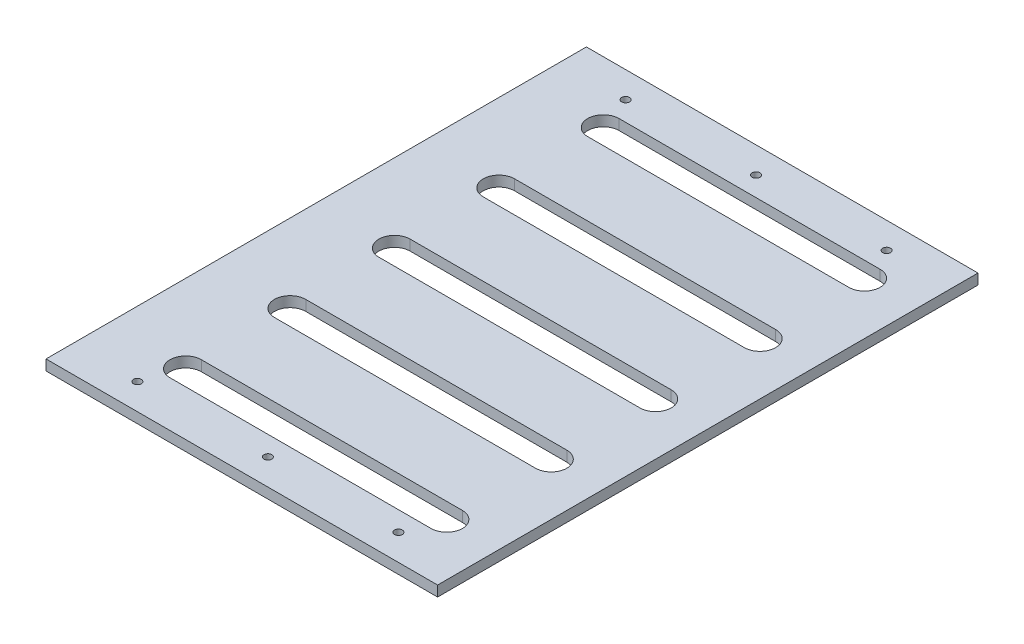
ISO-10303-21;
HEADER;
FILE_DESCRIPTION(('STEP AP214'),'2;1');
FILE_NAME('part.step','',(''),(''),'','','');
FILE_SCHEMA(('AUTOMOTIVE_DESIGN { 1 0 10303 214 1 1 1 1 }'));
ENDSEC;
DATA;
#1=APPLICATION_CONTEXT('core data for automotive mechanical design processes');
#2=APPLICATION_PROTOCOL_DEFINITION('international standard','automotive_design',2000,#1);
#3=PRODUCT_CONTEXT('',#1,'mechanical');
#4=PRODUCT('Part','Part','',(#3));
#5=PRODUCT_RELATED_PRODUCT_CATEGORY('part','',(#4));
#6=PRODUCT_DEFINITION_FORMATION('','',#4);
#7=PRODUCT_DEFINITION_CONTEXT('part definition',#1,'design');
#8=PRODUCT_DEFINITION('design','',#6,#7);
#9=PRODUCT_DEFINITION_SHAPE('','',#8);
#10=(LENGTH_UNIT() NAMED_UNIT(*) SI_UNIT(.MILLI.,.METRE.));
#11=(NAMED_UNIT(*) PLANE_ANGLE_UNIT() SI_UNIT($,.RADIAN.));
#12=(NAMED_UNIT(*) SI_UNIT($,.STERADIAN.) SOLID_ANGLE_UNIT());
#13=UNCERTAINTY_MEASURE_WITH_UNIT(LENGTH_MEASURE(1.E-05),#10,'distance_accuracy_value','');
#14=(GEOMETRIC_REPRESENTATION_CONTEXT(3) GLOBAL_UNCERTAINTY_ASSIGNED_CONTEXT((#13)) GLOBAL_UNIT_ASSIGNED_CONTEXT((#10,
#11,#12)) REPRESENTATION_CONTEXT('',''));
#15=CARTESIAN_POINT('',(0.,0.,0.));
#16=DIRECTION('',(0.,0.,1.));
#17=DIRECTION('',(1.,0.,0.));
#18=AXIS2_PLACEMENT_3D('',#15,#16,#17);
#19=CARTESIAN_POINT('',(0.,4.,0.));
#20=DIRECTION('',(1.,0.,0.));
#21=DIRECTION('',(0.,0.,-1.));
#22=AXIS2_PLACEMENT_3D('',#19,#20,#21);
#23=PLANE('',#22);
#24=DIRECTION('',(0.,0.,1.));
#25=VECTOR('',#24,1.);
#26=CARTESIAN_POINT('',(0.,0.,0.));
#27=LINE('',#26,#25);
#28=CARTESIAN_POINT('',(0.,0.,-207.));
#29=VERTEX_POINT('',#28);
#30=CARTESIAN_POINT('',(0.,0.,0.));
#31=VERTEX_POINT('',#30);
#32=EDGE_CURVE('E355',#29,#31,#27,.T.);
#33=ORIENTED_EDGE('',*,*,#32,.T.);
#34=DIRECTION('',(0.,-1.,0.));
#35=VECTOR('',#34,1.);
#36=CARTESIAN_POINT('',(0.,4.,0.));
#37=LINE('',#36,#35);
#38=CARTESIAN_POINT('',(0.,4.,0.));
#39=VERTEX_POINT('',#38);
#40=EDGE_CURVE('E11',#39,#31,#37,.T.);
#41=ORIENTED_EDGE('',*,*,#40,.F.);
#42=DIRECTION('',(0.,0.,1.));
#43=VECTOR('',#42,1.);
#44=CARTESIAN_POINT('',(0.,4.,0.));
#45=LINE('',#44,#43);
#46=CARTESIAN_POINT('',(0.,4.,-207.));
#47=VERTEX_POINT('',#46);
#48=EDGE_CURVE('E362',#47,#39,#45,.T.);
#49=ORIENTED_EDGE('',*,*,#48,.F.);
#50=DIRECTION('',(0.,-1.,0.));
#51=VECTOR('',#50,1.);
#52=CARTESIAN_POINT('',(0.,4.,-207.));
#53=LINE('',#52,#51);
#54=EDGE_CURVE('E372',#47,#29,#53,.T.);
#55=ORIENTED_EDGE('',*,*,#54,.T.);
#56=EDGE_LOOP('',(#33,#41,#49,#55));
#57=FACE_BOUND('',#56,.T.);
#58=ADVANCED_FACE('F32',(#57),#23,.F.);
#59=CARTESIAN_POINT('',(0.,4.,0.));
#60=DIRECTION('',(0.,0.,-1.));
#61=DIRECTION('',(-1.,0.,0.));
#62=AXIS2_PLACEMENT_3D('',#59,#60,#61);
#63=PLANE('',#62);
#64=DIRECTION('',(1.,0.,0.));
#65=VECTOR('',#64,1.);
#66=CARTESIAN_POINT('',(0.,0.,0.));
#67=LINE('',#66,#65);
#68=CARTESIAN_POINT('',(150.,0.,0.));
#69=VERTEX_POINT('',#68);
#70=EDGE_CURVE('E375',#31,#69,#67,.T.);
#71=ORIENTED_EDGE('',*,*,#70,.T.);
#72=DIRECTION('',(0.,-1.,0.));
#73=VECTOR('',#72,1.);
#74=CARTESIAN_POINT('',(150.,4.,0.));
#75=LINE('',#74,#73);
#76=CARTESIAN_POINT('',(150.,4.,0.));
#77=VERTEX_POINT('',#76);
#78=EDGE_CURVE('E39',#77,#69,#75,.T.);
#79=ORIENTED_EDGE('',*,*,#78,.F.);
#80=DIRECTION('',(1.,0.,0.));
#81=VECTOR('',#80,1.);
#82=CARTESIAN_POINT('',(0.,4.,0.));
#83=LINE('',#82,#81);
#84=EDGE_CURVE('E365',#39,#77,#83,.T.);
#85=ORIENTED_EDGE('',*,*,#84,.F.);
#86=ORIENTED_EDGE('',*,*,#40,.T.);
#87=EDGE_LOOP('',(#71,#79,#85,#86));
#88=FACE_BOUND('',#87,.T.);
#89=ADVANCED_FACE('F404',(#88),#63,.F.);
#90=CARTESIAN_POINT('',(150.,4.,0.));
#91=DIRECTION('',(-1.,0.,0.));
#92=DIRECTION('',(0.,0.,1.));
#93=AXIS2_PLACEMENT_3D('',#90,#91,#92);
#94=PLANE('',#93);
#95=DIRECTION('',(0.,0.,-1.));
#96=VECTOR('',#95,1.);
#97=CARTESIAN_POINT('',(150.,0.,0.));
#98=LINE('',#97,#96);
#99=CARTESIAN_POINT('',(150.,0.,-207.));
#100=VERTEX_POINT('',#99);
#101=EDGE_CURVE('E377',#69,#100,#98,.T.);
#102=ORIENTED_EDGE('',*,*,#101,.T.);
#103=DIRECTION('',(0.,-1.,0.));
#104=VECTOR('',#103,1.);
#105=CARTESIAN_POINT('',(150.,4.,-207.));
#106=LINE('',#105,#104);
#107=CARTESIAN_POINT('',(150.,4.,-207.));
#108=VERTEX_POINT('',#107);
#109=EDGE_CURVE('E382',#108,#100,#106,.T.);
#110=ORIENTED_EDGE('',*,*,#109,.F.);
#111=DIRECTION('',(0.,0.,-1.));
#112=VECTOR('',#111,1.);
#113=CARTESIAN_POINT('',(150.,4.,0.));
#114=LINE('',#113,#112);
#115=EDGE_CURVE('E368',#77,#108,#114,.T.);
#116=ORIENTED_EDGE('',*,*,#115,.F.);
#117=ORIENTED_EDGE('',*,*,#78,.T.);
#118=EDGE_LOOP('',(#102,#110,#116,#117));
#119=FACE_BOUND('',#118,.T.);
#120=ADVANCED_FACE('F389',(#119),#94,.F.);
#121=CARTESIAN_POINT('',(0.,4.,-207.));
#122=DIRECTION('',(0.,0.,1.));
#123=DIRECTION('',(1.,0.,0.));
#124=AXIS2_PLACEMENT_3D('',#121,#122,#123);
#125=PLANE('',#124);
#126=DIRECTION('',(-1.,0.,0.));
#127=VECTOR('',#126,1.);
#128=CARTESIAN_POINT('',(0.,0.,-207.));
#129=LINE('',#128,#127);
#130=EDGE_CURVE('E366',#100,#29,#129,.T.);
#131=ORIENTED_EDGE('',*,*,#130,.T.);
#132=ORIENTED_EDGE('',*,*,#54,.F.);
#133=DIRECTION('',(-1.,0.,0.));
#134=VECTOR('',#133,1.);
#135=CARTESIAN_POINT('',(0.,4.,-207.));
#136=LINE('',#135,#134);
#137=EDGE_CURVE('E370',#108,#47,#136,.T.);
#138=ORIENTED_EDGE('',*,*,#137,.F.);
#139=ORIENTED_EDGE('',*,*,#109,.T.);
#140=EDGE_LOOP('',(#131,#132,#138,#139));
#141=FACE_BOUND('',#140,.T.);
#142=ADVANCED_FACE('F397',(#141),#125,.F.);
#143=CARTESIAN_POINT('',(0.,4.,0.));
#144=DIRECTION('',(0.,-1.,0.));
#145=DIRECTION('',(0.,0.,-1.));
#146=AXIS2_PLACEMENT_3D('',#143,#144,#145);
#147=PLANE('',#146);
#148=CARTESIAN_POINT('',(75.,4.,-197.));
#149=DIRECTION('',(0.,1.,0.));
#150=DIRECTION('',(0.,0.,1.));
#151=AXIS2_PLACEMENT_3D('',#148,#149,#150);
#152=CIRCLE('',#151,1.50000000000001);
#153=CARTESIAN_POINT('',(75.,4.,-195.5));
#154=VERTEX_POINT('',#153);
#155=EDGE_CURVE('E526',#154,#154,#152,.T.);
#156=ORIENTED_EDGE('',*,*,#155,.F.);
#157=EDGE_LOOP('',(#156));
#158=FACE_BOUND('',#157,.T.);
#159=CARTESIAN_POINT('',(25.,4.,-197.));
#160=DIRECTION('',(0.,1.,0.));
#161=DIRECTION('',(0.,0.,1.));
#162=AXIS2_PLACEMENT_3D('',#159,#160,#161);
#163=CIRCLE('',#162,1.5);
#164=CARTESIAN_POINT('',(25.,4.,-195.5));
#165=VERTEX_POINT('',#164);
#166=EDGE_CURVE('E531',#165,#165,#163,.T.);
#167=ORIENTED_EDGE('',*,*,#166,.F.);
#168=EDGE_LOOP('',(#167));
#169=FACE_BOUND('',#168,.T.);
#170=CARTESIAN_POINT('',(25.,4.,-10.));
#171=DIRECTION('',(0.,1.,0.));
#172=DIRECTION('',(0.,0.,-1.));
#173=AXIS2_PLACEMENT_3D('',#170,#171,#172);
#174=CIRCLE('',#173,1.5);
#175=CARTESIAN_POINT('',(25.,4.,-11.5));
#176=VERTEX_POINT('',#175);
#177=EDGE_CURVE('E539',#176,#176,#174,.T.);
#178=ORIENTED_EDGE('',*,*,#177,.F.);
#179=EDGE_LOOP('',(#178));
#180=FACE_BOUND('',#179,.T.);
#181=CARTESIAN_POINT('',(75.,4.,-9.99999999999995));
#182=DIRECTION('',(0.,1.,0.));
#183=DIRECTION('',(0.,0.,-1.));
#184=AXIS2_PLACEMENT_3D('',#181,#182,#183);
#185=CIRCLE('',#184,1.50000000000001);
#186=CARTESIAN_POINT('',(75.,4.,-11.5));
#187=VERTEX_POINT('',#186);
#188=EDGE_CURVE('E545',#187,#187,#185,.T.);
#189=ORIENTED_EDGE('',*,*,#188,.F.);
#190=EDGE_LOOP('',(#189));
#191=FACE_BOUND('',#190,.T.);
#192=CARTESIAN_POINT('',(125.,4.,-10.));
#193=DIRECTION('',(0.,1.,0.));
#194=DIRECTION('',(0.,0.,-1.));
#195=AXIS2_PLACEMENT_3D('',#192,#193,#194);
#196=CIRCLE('',#195,1.5);
#197=CARTESIAN_POINT('',(125.,4.,-11.5));
#198=VERTEX_POINT('',#197);
#199=EDGE_CURVE('E551',#198,#198,#196,.T.);
#200=ORIENTED_EDGE('',*,*,#199,.F.);
#201=EDGE_LOOP('',(#200));
#202=FACE_BOUND('',#201,.T.);
#203=CARTESIAN_POINT('',(125.,4.,-197.));
#204=DIRECTION('',(0.,1.,0.));
#205=DIRECTION('',(0.,0.,1.));
#206=AXIS2_PLACEMENT_3D('',#203,#204,#205);
#207=CIRCLE('',#206,1.5);
#208=CARTESIAN_POINT('',(125.,4.,-195.5));
#209=VERTEX_POINT('',#208);
#210=EDGE_CURVE('E219',#209,#209,#207,.T.);
#211=ORIENTED_EDGE('',*,*,#210,.F.);
#212=EDGE_LOOP('',(#211));
#213=FACE_BOUND('',#212,.T.);
#214=DIRECTION('',(1.,0.,0.));
#215=VECTOR('',#214,1.);
#216=CARTESIAN_POINT('',(30.,4.,-137.5));
#217=LINE('',#216,#215);
#218=CARTESIAN_POINT('',(30.,4.,-137.5));
#219=VERTEX_POINT('',#218);
#220=CARTESIAN_POINT('',(130.,4.,-137.5));
#221=VERTEX_POINT('',#220);
#222=EDGE_CURVE('E225',#219,#221,#217,.T.);
#223=ORIENTED_EDGE('',*,*,#222,.F.);
#224=CARTESIAN_POINT('',(30.,4.,-143.5));
#225=DIRECTION('',(0.,1.,0.));
#226=DIRECTION('',(0.,0.,1.));
#227=AXIS2_PLACEMENT_3D('',#224,#225,#226);
#228=CIRCLE('',#227,6.00000000000001);
#229=CARTESIAN_POINT('',(30.,4.,-149.5));
#230=VERTEX_POINT('',#229);
#231=EDGE_CURVE('E46',#230,#219,#228,.T.);
#232=ORIENTED_EDGE('',*,*,#231,.F.);
#233=DIRECTION('',(-1.,0.,0.));
#234=VECTOR('',#233,1.);
#235=CARTESIAN_POINT('',(30.,4.,-149.5));
#236=LINE('',#235,#234);
#237=CARTESIAN_POINT('',(130.,4.,-149.5));
#238=VERTEX_POINT('',#237);
#239=EDGE_CURVE('E213',#238,#230,#236,.T.);
#240=ORIENTED_EDGE('',*,*,#239,.F.);
#241=CARTESIAN_POINT('',(130.,4.,-143.5));
#242=DIRECTION('',(0.,1.,0.));
#243=DIRECTION('',(0.,0.,1.));
#244=AXIS2_PLACEMENT_3D('',#241,#242,#243);
#245=CIRCLE('',#244,6.00000000000001);
#246=EDGE_CURVE('E216',#221,#238,#245,.T.);
#247=ORIENTED_EDGE('',*,*,#246,.F.);
#248=EDGE_LOOP('',(#223,#232,#240,#247));
#249=FACE_BOUND('',#248,.T.);
#250=DIRECTION('',(1.,0.,0.));
#251=VECTOR('',#250,1.);
#252=CARTESIAN_POINT('',(30.,4.,-97.5));
#253=LINE('',#252,#251);
#254=CARTESIAN_POINT('',(30.,4.,-97.5));
#255=VERTEX_POINT('',#254);
#256=CARTESIAN_POINT('',(130.,4.,-97.5));
#257=VERTEX_POINT('',#256);
#258=EDGE_CURVE('E251',#255,#257,#253,.T.);
#259=ORIENTED_EDGE('',*,*,#258,.F.);
#260=CARTESIAN_POINT('',(30.,4.,-103.5));
#261=DIRECTION('',(0.,1.,0.));
#262=DIRECTION('',(0.,0.,-1.));
#263=AXIS2_PLACEMENT_3D('',#260,#261,#262);
#264=CIRCLE('',#263,6.00000000000001);
#265=CARTESIAN_POINT('',(30.,4.,-109.5));
#266=VERTEX_POINT('',#265);
#267=EDGE_CURVE('E54',#266,#255,#264,.T.);
#268=ORIENTED_EDGE('',*,*,#267,.F.);
#269=DIRECTION('',(-1.,0.,0.));
#270=VECTOR('',#269,1.);
#271=CARTESIAN_POINT('',(30.,4.,-109.5));
#272=LINE('',#271,#270);
#273=CARTESIAN_POINT('',(130.,4.,-109.5));
#274=VERTEX_POINT('',#273);
#275=EDGE_CURVE('E240',#274,#266,#272,.T.);
#276=ORIENTED_EDGE('',*,*,#275,.F.);
#277=CARTESIAN_POINT('',(130.,4.,-103.5));
#278=DIRECTION('',(0.,1.,0.));
#279=DIRECTION('',(0.,0.,-1.));
#280=AXIS2_PLACEMENT_3D('',#277,#278,#279);
#281=CIRCLE('',#280,6.00000000000001);
#282=EDGE_CURVE('E255',#257,#274,#281,.T.);
#283=ORIENTED_EDGE('',*,*,#282,.F.);
#284=EDGE_LOOP('',(#259,#268,#276,#283));
#285=FACE_BOUND('',#284,.T.);
#286=DIRECTION('',(1.,0.,0.));
#287=VECTOR('',#286,1.);
#288=CARTESIAN_POINT('',(30.,4.,-57.5));
#289=LINE('',#288,#287);
#290=CARTESIAN_POINT('',(30.,4.,-57.5));
#291=VERTEX_POINT('',#290);
#292=CARTESIAN_POINT('',(130.,4.,-57.5));
#293=VERTEX_POINT('',#292);
#294=EDGE_CURVE('E282',#291,#293,#289,.T.);
#295=ORIENTED_EDGE('',*,*,#294,.F.);
#296=CARTESIAN_POINT('',(30.,4.,-63.5));
#297=DIRECTION('',(0.,1.,0.));
#298=DIRECTION('',(0.,0.,-1.));
#299=AXIS2_PLACEMENT_3D('',#296,#297,#298);
#300=CIRCLE('',#299,6.00000000000001);
#301=CARTESIAN_POINT('',(30.,4.,-69.5));
#302=VERTEX_POINT('',#301);
#303=EDGE_CURVE('E280',#302,#291,#300,.T.);
#304=ORIENTED_EDGE('',*,*,#303,.F.);
#305=DIRECTION('',(-1.,0.,0.));
#306=VECTOR('',#305,1.);
#307=CARTESIAN_POINT('',(30.,4.,-69.5));
#308=LINE('',#307,#306);
#309=CARTESIAN_POINT('',(130.,4.,-69.5000000000001));
#310=VERTEX_POINT('',#309);
#311=EDGE_CURVE('E270',#310,#302,#308,.T.);
#312=ORIENTED_EDGE('',*,*,#311,.F.);
#313=CARTESIAN_POINT('',(130.,4.,-63.5000000000001));
#314=DIRECTION('',(0.,1.,0.));
#315=DIRECTION('',(0.,0.,-1.));
#316=AXIS2_PLACEMENT_3D('',#313,#314,#315);
#317=CIRCLE('',#316,6.00000000000001);
#318=EDGE_CURVE('E286',#293,#310,#317,.T.);
#319=ORIENTED_EDGE('',*,*,#318,.F.);
#320=EDGE_LOOP('',(#295,#304,#312,#319));
#321=FACE_BOUND('',#320,.T.);
#322=DIRECTION('',(1.,0.,0.));
#323=VECTOR('',#322,1.);
#324=CARTESIAN_POINT('',(30.,4.,-17.5));
#325=LINE('',#324,#323);
#326=CARTESIAN_POINT('',(30.,4.,-17.5));
#327=VERTEX_POINT('',#326);
#328=CARTESIAN_POINT('',(130.,4.,-17.5));
#329=VERTEX_POINT('',#328);
#330=EDGE_CURVE('E314',#327,#329,#325,.T.);
#331=ORIENTED_EDGE('',*,*,#330,.F.);
#332=CARTESIAN_POINT('',(30.,4.,-23.5));
#333=DIRECTION('',(0.,1.,0.));
#334=DIRECTION('',(0.,0.,-1.));
#335=AXIS2_PLACEMENT_3D('',#332,#333,#334);
#336=CIRCLE('',#335,5.99999999999998);
#337=CARTESIAN_POINT('',(30.,4.,-29.5));
#338=VERTEX_POINT('',#337);
#339=EDGE_CURVE('E312',#338,#327,#336,.T.);
#340=ORIENTED_EDGE('',*,*,#339,.F.);
#341=DIRECTION('',(-1.,0.,0.));
#342=VECTOR('',#341,1.);
#343=CARTESIAN_POINT('',(30.,4.,-29.5));
#344=LINE('',#343,#342);
#345=CARTESIAN_POINT('',(130.,4.,-29.5));
#346=VERTEX_POINT('',#345);
#347=EDGE_CURVE('E302',#346,#338,#344,.T.);
#348=ORIENTED_EDGE('',*,*,#347,.F.);
#349=CARTESIAN_POINT('',(130.,4.,-23.5));
#350=DIRECTION('',(0.,1.,0.));
#351=DIRECTION('',(0.,0.,-1.));
#352=AXIS2_PLACEMENT_3D('',#349,#350,#351);
#353=CIRCLE('',#352,6.);
#354=EDGE_CURVE('E318',#329,#346,#353,.T.);
#355=ORIENTED_EDGE('',*,*,#354,.F.);
#356=EDGE_LOOP('',(#331,#340,#348,#355));
#357=FACE_BOUND('',#356,.T.);
#358=DIRECTION('',(1.,0.,0.));
#359=VECTOR('',#358,1.);
#360=CARTESIAN_POINT('',(30.,4.,-177.5));
#361=LINE('',#360,#359);
#362=CARTESIAN_POINT('',(30.,4.,-177.5));
#363=VERTEX_POINT('',#362);
#364=CARTESIAN_POINT('',(130.,4.,-177.5));
#365=VERTEX_POINT('',#364);
#366=EDGE_CURVE('E345',#363,#365,#361,.T.);
#367=ORIENTED_EDGE('',*,*,#366,.F.);
#368=CARTESIAN_POINT('',(30.,4.,-183.5));
#369=DIRECTION('',(0.,1.,0.));
#370=DIRECTION('',(0.,0.,1.));
#371=AXIS2_PLACEMENT_3D('',#368,#369,#370);
#372=CIRCLE('',#371,5.99999999999998);
#373=CARTESIAN_POINT('',(30.,4.,-189.5));
#374=VERTEX_POINT('',#373);
#375=EDGE_CURVE('E232',#374,#363,#372,.T.);
#376=ORIENTED_EDGE('',*,*,#375,.F.);
#377=DIRECTION('',(-1.,0.,0.));
#378=VECTOR('',#377,1.);
#379=CARTESIAN_POINT('',(30.,4.,-189.5));
#380=LINE('',#379,#378);
#381=CARTESIAN_POINT('',(130.,4.,-189.5));
#382=VERTEX_POINT('',#381);
#383=EDGE_CURVE('E334',#382,#374,#380,.T.);
#384=ORIENTED_EDGE('',*,*,#383,.F.);
#385=CARTESIAN_POINT('',(130.,4.,-183.5));
#386=DIRECTION('',(0.,1.,0.));
#387=DIRECTION('',(0.,0.,1.));
#388=AXIS2_PLACEMENT_3D('',#385,#386,#387);
#389=CIRCLE('',#388,5.99999999999999);
#390=EDGE_CURVE('E348',#365,#382,#389,.T.);
#391=ORIENTED_EDGE('',*,*,#390,.F.);
#392=EDGE_LOOP('',(#367,#376,#384,#391));
#393=FACE_BOUND('',#392,.T.);
#394=ORIENTED_EDGE('',*,*,#48,.T.);
#395=ORIENTED_EDGE('',*,*,#84,.T.);
#396=ORIENTED_EDGE('',*,*,#115,.T.);
#397=ORIENTED_EDGE('',*,*,#137,.T.);
#398=EDGE_LOOP('',(#394,#395,#396,#397));
#399=FACE_BOUND('',#398,.T.);
#400=ADVANCED_FACE('F403',(#158,#169,#180,#191,#202,#213,#249,#285,#321,#357,#393,#399),#147,.F.);
#401=CARTESIAN_POINT('',(0.,0.,0.));
#402=DIRECTION('',(0.,-1.,0.));
#403=DIRECTION('',(0.,0.,-1.));
#404=AXIS2_PLACEMENT_3D('',#401,#402,#403);
#405=PLANE('',#404);
#406=CARTESIAN_POINT('',(75.,0.,-197.));
#407=DIRECTION('',(0.,1.,0.));
#408=DIRECTION('',(0.,0.,1.));
#409=AXIS2_PLACEMENT_3D('',#406,#407,#408);
#410=CIRCLE('',#409,1.50000000000001);
#411=CARTESIAN_POINT('',(75.,0.,-195.5));
#412=VERTEX_POINT('',#411);
#413=EDGE_CURVE('E523',#412,#412,#410,.T.);
#414=ORIENTED_EDGE('',*,*,#413,.T.);
#415=EDGE_LOOP('',(#414));
#416=FACE_BOUND('',#415,.T.);
#417=CARTESIAN_POINT('',(25.,0.,-197.));
#418=DIRECTION('',(0.,1.,0.));
#419=DIRECTION('',(0.,0.,1.));
#420=AXIS2_PLACEMENT_3D('',#417,#418,#419);
#421=CIRCLE('',#420,1.5);
#422=CARTESIAN_POINT('',(25.,0.,-195.5));
#423=VERTEX_POINT('',#422);
#424=EDGE_CURVE('E527',#423,#423,#421,.T.);
#425=ORIENTED_EDGE('',*,*,#424,.T.);
#426=EDGE_LOOP('',(#425));
#427=FACE_BOUND('',#426,.T.);
#428=CARTESIAN_POINT('',(25.,0.,-10.));
#429=DIRECTION('',(0.,1.,0.));
#430=DIRECTION('',(0.,0.,-1.));
#431=AXIS2_PLACEMENT_3D('',#428,#429,#430);
#432=CIRCLE('',#431,1.5);
#433=CARTESIAN_POINT('',(25.,0.,-11.5));
#434=VERTEX_POINT('',#433);
#435=EDGE_CURVE('E536',#434,#434,#432,.T.);
#436=ORIENTED_EDGE('',*,*,#435,.T.);
#437=EDGE_LOOP('',(#436));
#438=FACE_BOUND('',#437,.T.);
#439=CARTESIAN_POINT('',(75.,0.,-9.99999999999995));
#440=DIRECTION('',(0.,1.,0.));
#441=DIRECTION('',(0.,0.,-1.));
#442=AXIS2_PLACEMENT_3D('',#439,#440,#441);
#443=CIRCLE('',#442,1.50000000000001);
#444=CARTESIAN_POINT('',(75.,0.,-11.5));
#445=VERTEX_POINT('',#444);
#446=EDGE_CURVE('E542',#445,#445,#443,.T.);
#447=ORIENTED_EDGE('',*,*,#446,.T.);
#448=EDGE_LOOP('',(#447));
#449=FACE_BOUND('',#448,.T.);
#450=CARTESIAN_POINT('',(125.,0.,-10.));
#451=DIRECTION('',(0.,1.,0.));
#452=DIRECTION('',(0.,0.,-1.));
#453=AXIS2_PLACEMENT_3D('',#450,#451,#452);
#454=CIRCLE('',#453,1.5);
#455=CARTESIAN_POINT('',(125.,0.,-11.5));
#456=VERTEX_POINT('',#455);
#457=EDGE_CURVE('E548',#456,#456,#454,.T.);
#458=ORIENTED_EDGE('',*,*,#457,.T.);
#459=EDGE_LOOP('',(#458));
#460=FACE_BOUND('',#459,.T.);
#461=CARTESIAN_POINT('',(125.,0.,-197.));
#462=DIRECTION('',(0.,1.,0.));
#463=DIRECTION('',(0.,0.,1.));
#464=AXIS2_PLACEMENT_3D('',#461,#462,#463);
#465=CIRCLE('',#464,1.5);
#466=CARTESIAN_POINT('',(125.,0.,-195.5));
#467=VERTEX_POINT('',#466);
#468=EDGE_CURVE('E315',#467,#467,#465,.T.);
#469=ORIENTED_EDGE('',*,*,#468,.T.);
#470=EDGE_LOOP('',(#469));
#471=FACE_BOUND('',#470,.T.);
#472=CARTESIAN_POINT('',(30.,0.,-143.5));
#473=DIRECTION('',(0.,1.,0.));
#474=DIRECTION('',(0.,0.,1.));
#475=AXIS2_PLACEMENT_3D('',#472,#473,#474);
#476=CIRCLE('',#475,6.00000000000001);
#477=CARTESIAN_POINT('',(30.,0.,-149.5));
#478=VERTEX_POINT('',#477);
#479=CARTESIAN_POINT('',(30.,0.,-137.5));
#480=VERTEX_POINT('',#479);
#481=EDGE_CURVE('E194',#478,#480,#476,.T.);
#482=ORIENTED_EDGE('',*,*,#481,.T.);
#483=DIRECTION('',(1.,0.,0.));
#484=VECTOR('',#483,1.);
#485=CARTESIAN_POINT('',(30.,0.,-137.5));
#486=LINE('',#485,#484);
#487=CARTESIAN_POINT('',(130.,0.,-137.5));
#488=VERTEX_POINT('',#487);
#489=EDGE_CURVE('E204',#480,#488,#486,.T.);
#490=ORIENTED_EDGE('',*,*,#489,.T.);
#491=CARTESIAN_POINT('',(130.,0.,-143.5));
#492=DIRECTION('',(0.,1.,0.));
#493=DIRECTION('',(0.,0.,1.));
#494=AXIS2_PLACEMENT_3D('',#491,#492,#493);
#495=CIRCLE('',#494,6.00000000000001);
#496=CARTESIAN_POINT('',(130.,0.,-149.5));
#497=VERTEX_POINT('',#496);
#498=EDGE_CURVE('E208',#488,#497,#495,.T.);
#499=ORIENTED_EDGE('',*,*,#498,.T.);
#500=DIRECTION('',(-1.,0.,0.));
#501=VECTOR('',#500,1.);
#502=CARTESIAN_POINT('',(30.,0.,-149.5));
#503=LINE('',#502,#501);
#504=EDGE_CURVE('E200',#497,#478,#503,.T.);
#505=ORIENTED_EDGE('',*,*,#504,.T.);
#506=EDGE_LOOP('',(#482,#490,#499,#505));
#507=FACE_BOUND('',#506,.T.);
#508=CARTESIAN_POINT('',(30.,0.,-103.5));
#509=DIRECTION('',(0.,1.,0.));
#510=DIRECTION('',(0.,0.,-1.));
#511=AXIS2_PLACEMENT_3D('',#508,#509,#510);
#512=CIRCLE('',#511,6.00000000000001);
#513=CARTESIAN_POINT('',(30.,0.,-109.5));
#514=VERTEX_POINT('',#513);
#515=CARTESIAN_POINT('',(30.,0.,-97.5));
#516=VERTEX_POINT('',#515);
#517=EDGE_CURVE('E236',#514,#516,#512,.T.);
#518=ORIENTED_EDGE('',*,*,#517,.T.);
#519=DIRECTION('',(1.,0.,0.));
#520=VECTOR('',#519,1.);
#521=CARTESIAN_POINT('',(30.,0.,-97.5));
#522=LINE('',#521,#520);
#523=CARTESIAN_POINT('',(130.,0.,-97.5));
#524=VERTEX_POINT('',#523);
#525=EDGE_CURVE('E239',#516,#524,#522,.T.);
#526=ORIENTED_EDGE('',*,*,#525,.T.);
#527=CARTESIAN_POINT('',(130.,0.,-103.5));
#528=DIRECTION('',(0.,1.,0.));
#529=DIRECTION('',(0.,0.,-1.));
#530=AXIS2_PLACEMENT_3D('',#527,#528,#529);
#531=CIRCLE('',#530,6.00000000000001);
#532=CARTESIAN_POINT('',(130.,0.,-109.5));
#533=VERTEX_POINT('',#532);
#534=EDGE_CURVE('E243',#524,#533,#531,.T.);
#535=ORIENTED_EDGE('',*,*,#534,.T.);
#536=DIRECTION('',(-1.,0.,0.));
#537=VECTOR('',#536,1.);
#538=CARTESIAN_POINT('',(30.,0.,-109.5));
#539=LINE('',#538,#537);
#540=EDGE_CURVE('E246',#533,#514,#539,.T.);
#541=ORIENTED_EDGE('',*,*,#540,.T.);
#542=EDGE_LOOP('',(#518,#526,#535,#541));
#543=FACE_BOUND('',#542,.T.);
#544=CARTESIAN_POINT('',(30.,0.,-63.5));
#545=DIRECTION('',(0.,1.,0.));
#546=DIRECTION('',(0.,0.,-1.));
#547=AXIS2_PLACEMENT_3D('',#544,#545,#546);
#548=CIRCLE('',#547,6.00000000000001);
#549=CARTESIAN_POINT('',(30.,0.,-69.5));
#550=VERTEX_POINT('',#549);
#551=CARTESIAN_POINT('',(30.,0.,-57.5));
#552=VERTEX_POINT('',#551);
#553=EDGE_CURVE('E266',#550,#552,#548,.T.);
#554=ORIENTED_EDGE('',*,*,#553,.T.);
#555=DIRECTION('',(1.,0.,0.));
#556=VECTOR('',#555,1.);
#557=CARTESIAN_POINT('',(30.,0.,-57.5));
#558=LINE('',#557,#556);
#559=CARTESIAN_POINT('',(130.,0.,-57.5));
#560=VERTEX_POINT('',#559);
#561=EDGE_CURVE('E269',#552,#560,#558,.T.);
#562=ORIENTED_EDGE('',*,*,#561,.T.);
#563=CARTESIAN_POINT('',(130.,0.,-63.5000000000001));
#564=DIRECTION('',(0.,1.,0.));
#565=DIRECTION('',(0.,0.,-1.));
#566=AXIS2_PLACEMENT_3D('',#563,#564,#565);
#567=CIRCLE('',#566,6.00000000000001);
#568=CARTESIAN_POINT('',(130.,0.,-69.5000000000001));
#569=VERTEX_POINT('',#568);
#570=EDGE_CURVE('E273',#560,#569,#567,.T.);
#571=ORIENTED_EDGE('',*,*,#570,.T.);
#572=DIRECTION('',(-1.,0.,0.));
#573=VECTOR('',#572,1.);
#574=CARTESIAN_POINT('',(30.,0.,-69.5));
#575=LINE('',#574,#573);
#576=EDGE_CURVE('E276',#569,#550,#575,.T.);
#577=ORIENTED_EDGE('',*,*,#576,.T.);
#578=EDGE_LOOP('',(#554,#562,#571,#577));
#579=FACE_BOUND('',#578,.T.);
#580=CARTESIAN_POINT('',(30.,0.,-23.5));
#581=DIRECTION('',(0.,1.,0.));
#582=DIRECTION('',(0.,0.,-1.));
#583=AXIS2_PLACEMENT_3D('',#580,#581,#582);
#584=CIRCLE('',#583,5.99999999999998);
#585=CARTESIAN_POINT('',(30.,0.,-29.5));
#586=VERTEX_POINT('',#585);
#587=CARTESIAN_POINT('',(30.,0.,-17.5));
#588=VERTEX_POINT('',#587);
#589=EDGE_CURVE('E298',#586,#588,#584,.T.);
#590=ORIENTED_EDGE('',*,*,#589,.T.);
#591=DIRECTION('',(1.,0.,0.));
#592=VECTOR('',#591,1.);
#593=CARTESIAN_POINT('',(30.,0.,-17.5));
#594=LINE('',#593,#592);
#595=CARTESIAN_POINT('',(130.,0.,-17.5));
#596=VERTEX_POINT('',#595);
#597=EDGE_CURVE('E301',#588,#596,#594,.T.);
#598=ORIENTED_EDGE('',*,*,#597,.T.);
#599=CARTESIAN_POINT('',(130.,0.,-23.5));
#600=DIRECTION('',(0.,1.,0.));
#601=DIRECTION('',(0.,0.,-1.));
#602=AXIS2_PLACEMENT_3D('',#599,#600,#601);
#603=CIRCLE('',#602,6.);
#604=CARTESIAN_POINT('',(130.,0.,-29.5));
#605=VERTEX_POINT('',#604);
#606=EDGE_CURVE('E305',#596,#605,#603,.T.);
#607=ORIENTED_EDGE('',*,*,#606,.T.);
#608=DIRECTION('',(-1.,0.,0.));
#609=VECTOR('',#608,1.);
#610=CARTESIAN_POINT('',(30.,0.,-29.5));
#611=LINE('',#610,#609);
#612=EDGE_CURVE('E308',#605,#586,#611,.T.);
#613=ORIENTED_EDGE('',*,*,#612,.T.);
#614=EDGE_LOOP('',(#590,#598,#607,#613));
#615=FACE_BOUND('',#614,.T.);
#616=CARTESIAN_POINT('',(30.,0.,-183.5));
#617=DIRECTION('',(0.,1.,0.));
#618=DIRECTION('',(0.,0.,1.));
#619=AXIS2_PLACEMENT_3D('',#616,#617,#618);
#620=CIRCLE('',#619,5.99999999999998);
#621=CARTESIAN_POINT('',(30.,0.,-189.5));
#622=VERTEX_POINT('',#621);
#623=CARTESIAN_POINT('',(30.,0.,-177.5));
#624=VERTEX_POINT('',#623);
#625=EDGE_CURVE('E330',#622,#624,#620,.T.);
#626=ORIENTED_EDGE('',*,*,#625,.T.);
#627=DIRECTION('',(1.,0.,0.));
#628=VECTOR('',#627,1.);
#629=CARTESIAN_POINT('',(30.,0.,-177.5));
#630=LINE('',#629,#628);
#631=CARTESIAN_POINT('',(130.,0.,-177.5));
#632=VERTEX_POINT('',#631);
#633=EDGE_CURVE('E333',#624,#632,#630,.T.);
#634=ORIENTED_EDGE('',*,*,#633,.T.);
#635=CARTESIAN_POINT('',(130.,0.,-183.5));
#636=DIRECTION('',(0.,1.,0.));
#637=DIRECTION('',(0.,0.,1.));
#638=AXIS2_PLACEMENT_3D('',#635,#636,#637);
#639=CIRCLE('',#638,5.99999999999999);
#640=CARTESIAN_POINT('',(130.,0.,-189.5));
#641=VERTEX_POINT('',#640);
#642=EDGE_CURVE('E337',#632,#641,#639,.T.);
#643=ORIENTED_EDGE('',*,*,#642,.T.);
#644=DIRECTION('',(-1.,0.,0.));
#645=VECTOR('',#644,1.);
#646=CARTESIAN_POINT('',(30.,0.,-189.5));
#647=LINE('',#646,#645);
#648=EDGE_CURVE('E340',#641,#622,#647,.T.);
#649=ORIENTED_EDGE('',*,*,#648,.T.);
#650=EDGE_LOOP('',(#626,#634,#643,#649));
#651=FACE_BOUND('',#650,.T.);
#652=ORIENTED_EDGE('',*,*,#32,.F.);
#653=ORIENTED_EDGE('',*,*,#130,.F.);
#654=ORIENTED_EDGE('',*,*,#101,.F.);
#655=ORIENTED_EDGE('',*,*,#70,.F.);
#656=EDGE_LOOP('',(#652,#653,#654,#655));
#657=FACE_BOUND('',#656,.T.);
#658=ADVANCED_FACE('F210',(#416,#427,#438,#449,#460,#471,#507,#543,#579,#615,#651,#657),#405,.T.);
#659=CARTESIAN_POINT('',(30.,0.,-183.5));
#660=DIRECTION('',(0.,1.,0.));
#661=DIRECTION('',(0.,0.,1.));
#662=AXIS2_PLACEMENT_3D('',#659,#660,#661);
#663=CYLINDRICAL_SURFACE('',#662,5.99999999999998);
#664=ORIENTED_EDGE('',*,*,#375,.T.);
#665=DIRECTION('',(0.,1.,0.));
#666=VECTOR('',#665,1.);
#667=CARTESIAN_POINT('',(30.,0.,-177.5));
#668=LINE('',#667,#666);
#669=EDGE_CURVE('E343',#624,#363,#668,.T.);
#670=ORIENTED_EDGE('',*,*,#669,.F.);
#671=ORIENTED_EDGE('',*,*,#625,.F.);
#672=DIRECTION('',(0.,1.,0.));
#673=VECTOR('',#672,1.);
#674=CARTESIAN_POINT('',(30.,0.,-189.5));
#675=LINE('',#674,#673);
#676=EDGE_CURVE('E353',#622,#374,#675,.T.);
#677=ORIENTED_EDGE('',*,*,#676,.T.);
#678=EDGE_LOOP('',(#664,#670,#671,#677));
#679=FACE_BOUND('',#678,.T.);
#680=ADVANCED_FACE('F416',(#679),#663,.F.);
#681=CARTESIAN_POINT('',(30.,0.,-189.5));
#682=DIRECTION('',(0.,0.,-1.));
#683=DIRECTION('',(-1.,0.,0.));
#684=AXIS2_PLACEMENT_3D('',#681,#682,#683);
#685=PLANE('',#684);
#686=ORIENTED_EDGE('',*,*,#383,.T.);
#687=ORIENTED_EDGE('',*,*,#676,.F.);
#688=ORIENTED_EDGE('',*,*,#648,.F.);
#689=DIRECTION('',(0.,1.,0.));
#690=VECTOR('',#689,1.);
#691=CARTESIAN_POINT('',(130.,0.,-189.5));
#692=LINE('',#691,#690);
#693=EDGE_CURVE('E356',#641,#382,#692,.T.);
#694=ORIENTED_EDGE('',*,*,#693,.T.);
#695=EDGE_LOOP('',(#686,#687,#688,#694));
#696=FACE_BOUND('',#695,.T.);
#697=ADVANCED_FACE('F423',(#696),#685,.F.);
#698=CARTESIAN_POINT('',(130.,0.,-183.5));
#699=DIRECTION('',(0.,1.,0.));
#700=DIRECTION('',(0.,0.,1.));
#701=AXIS2_PLACEMENT_3D('',#698,#699,#700);
#702=CYLINDRICAL_SURFACE('',#701,5.99999999999999);
#703=ORIENTED_EDGE('',*,*,#390,.T.);
#704=ORIENTED_EDGE('',*,*,#693,.F.);
#705=ORIENTED_EDGE('',*,*,#642,.F.);
#706=DIRECTION('',(0.,1.,0.));
#707=VECTOR('',#706,1.);
#708=CARTESIAN_POINT('',(130.,0.,-177.5));
#709=LINE('',#708,#707);
#710=EDGE_CURVE('E358',#632,#365,#709,.T.);
#711=ORIENTED_EDGE('',*,*,#710,.T.);
#712=EDGE_LOOP('',(#703,#704,#705,#711));
#713=FACE_BOUND('',#712,.T.);
#714=ADVANCED_FACE('F429',(#713),#702,.F.);
#715=CARTESIAN_POINT('',(30.,0.,-177.5));
#716=DIRECTION('',(0.,0.,1.));
#717=DIRECTION('',(1.,0.,0.));
#718=AXIS2_PLACEMENT_3D('',#715,#716,#717);
#719=PLANE('',#718);
#720=ORIENTED_EDGE('',*,*,#366,.T.);
#721=ORIENTED_EDGE('',*,*,#710,.F.);
#722=ORIENTED_EDGE('',*,*,#633,.F.);
#723=ORIENTED_EDGE('',*,*,#669,.T.);
#724=EDGE_LOOP('',(#720,#721,#722,#723));
#725=FACE_BOUND('',#724,.T.);
#726=ADVANCED_FACE('F425',(#725),#719,.F.);
#727=CARTESIAN_POINT('',(30.,0.,-23.5));
#728=DIRECTION('',(0.,1.,0.));
#729=DIRECTION('',(0.,0.,1.));
#730=AXIS2_PLACEMENT_3D('',#727,#728,#729);
#731=CYLINDRICAL_SURFACE('',#730,5.99999999999998);
#732=ORIENTED_EDGE('',*,*,#339,.T.);
#733=DIRECTION('',(0.,1.,0.));
#734=VECTOR('',#733,1.);
#735=CARTESIAN_POINT('',(30.,0.,-17.5));
#736=LINE('',#735,#734);
#737=EDGE_CURVE('E311',#588,#327,#736,.T.);
#738=ORIENTED_EDGE('',*,*,#737,.F.);
#739=ORIENTED_EDGE('',*,*,#589,.F.);
#740=DIRECTION('',(0.,1.,0.));
#741=VECTOR('',#740,1.);
#742=CARTESIAN_POINT('',(30.,0.,-29.5));
#743=LINE('',#742,#741);
#744=EDGE_CURVE('E283',#586,#338,#743,.T.);
#745=ORIENTED_EDGE('',*,*,#744,.T.);
#746=EDGE_LOOP('',(#732,#738,#739,#745));
#747=FACE_BOUND('',#746,.T.);
#748=ADVANCED_FACE('F428',(#747),#731,.F.);
#749=CARTESIAN_POINT('',(30.,0.,-29.5));
#750=DIRECTION('',(0.,0.,-1.));
#751=DIRECTION('',(-1.,0.,0.));
#752=AXIS2_PLACEMENT_3D('',#749,#750,#751);
#753=PLANE('',#752);
#754=ORIENTED_EDGE('',*,*,#347,.T.);
#755=ORIENTED_EDGE('',*,*,#744,.F.);
#756=ORIENTED_EDGE('',*,*,#612,.F.);
#757=DIRECTION('',(0.,1.,0.));
#758=VECTOR('',#757,1.);
#759=CARTESIAN_POINT('',(130.,0.,-29.5));
#760=LINE('',#759,#758);
#761=EDGE_CURVE('E324',#605,#346,#760,.T.);
#762=ORIENTED_EDGE('',*,*,#761,.T.);
#763=EDGE_LOOP('',(#754,#755,#756,#762));
#764=FACE_BOUND('',#763,.T.);
#765=ADVANCED_FACE('F439',(#764),#753,.F.);
#766=CARTESIAN_POINT('',(130.,0.,-23.5));
#767=DIRECTION('',(0.,1.,0.));
#768=DIRECTION('',(0.,0.,1.));
#769=AXIS2_PLACEMENT_3D('',#766,#767,#768);
#770=CYLINDRICAL_SURFACE('',#769,6.);
#771=ORIENTED_EDGE('',*,*,#354,.T.);
#772=ORIENTED_EDGE('',*,*,#761,.F.);
#773=ORIENTED_EDGE('',*,*,#606,.F.);
#774=DIRECTION('',(0.,1.,0.));
#775=VECTOR('',#774,1.);
#776=CARTESIAN_POINT('',(130.,0.,-17.5));
#777=LINE('',#776,#775);
#778=EDGE_CURVE('E326',#596,#329,#777,.T.);
#779=ORIENTED_EDGE('',*,*,#778,.T.);
#780=EDGE_LOOP('',(#771,#772,#773,#779));
#781=FACE_BOUND('',#780,.T.);
#782=ADVANCED_FACE('F445',(#781),#770,.F.);
#783=CARTESIAN_POINT('',(30.,0.,-17.5));
#784=DIRECTION('',(0.,0.,1.));
#785=DIRECTION('',(1.,0.,0.));
#786=AXIS2_PLACEMENT_3D('',#783,#784,#785);
#787=PLANE('',#786);
#788=ORIENTED_EDGE('',*,*,#330,.T.);
#789=ORIENTED_EDGE('',*,*,#778,.F.);
#790=ORIENTED_EDGE('',*,*,#597,.F.);
#791=ORIENTED_EDGE('',*,*,#737,.T.);
#792=EDGE_LOOP('',(#788,#789,#790,#791));
#793=FACE_BOUND('',#792,.T.);
#794=ADVANCED_FACE('F441',(#793),#787,.F.);
#795=CARTESIAN_POINT('',(30.,0.,-63.5));
#796=DIRECTION('',(0.,1.,0.));
#797=DIRECTION('',(0.,0.,1.));
#798=AXIS2_PLACEMENT_3D('',#795,#796,#797);
#799=CYLINDRICAL_SURFACE('',#798,6.00000000000001);
#800=ORIENTED_EDGE('',*,*,#303,.T.);
#801=DIRECTION('',(0.,1.,0.));
#802=VECTOR('',#801,1.);
#803=CARTESIAN_POINT('',(30.,0.,-57.5));
#804=LINE('',#803,#802);
#805=EDGE_CURVE('E279',#552,#291,#804,.T.);
#806=ORIENTED_EDGE('',*,*,#805,.F.);
#807=ORIENTED_EDGE('',*,*,#553,.F.);
#808=DIRECTION('',(0.,1.,0.));
#809=VECTOR('',#808,1.);
#810=CARTESIAN_POINT('',(30.,0.,-69.5));
#811=LINE('',#810,#809);
#812=EDGE_CURVE('E252',#550,#302,#811,.T.);
#813=ORIENTED_EDGE('',*,*,#812,.T.);
#814=EDGE_LOOP('',(#800,#806,#807,#813));
#815=FACE_BOUND('',#814,.T.);
#816=ADVANCED_FACE('F444',(#815),#799,.F.);
#817=CARTESIAN_POINT('',(30.,0.,-69.5));
#818=DIRECTION('',(0.,0.,-1.));
#819=DIRECTION('',(-1.,0.,0.));
#820=AXIS2_PLACEMENT_3D('',#817,#818,#819);
#821=PLANE('',#820);
#822=ORIENTED_EDGE('',*,*,#311,.T.);
#823=ORIENTED_EDGE('',*,*,#812,.F.);
#824=ORIENTED_EDGE('',*,*,#576,.F.);
#825=DIRECTION('',(0.,1.,0.));
#826=VECTOR('',#825,1.);
#827=CARTESIAN_POINT('',(130.,0.,-69.5000000000001));
#828=LINE('',#827,#826);
#829=EDGE_CURVE('E292',#569,#310,#828,.T.);
#830=ORIENTED_EDGE('',*,*,#829,.T.);
#831=EDGE_LOOP('',(#822,#823,#824,#830));
#832=FACE_BOUND('',#831,.T.);
#833=ADVANCED_FACE('F455',(#832),#821,.F.);
#834=CARTESIAN_POINT('',(130.,0.,-63.5000000000001));
#835=DIRECTION('',(0.,1.,0.));
#836=DIRECTION('',(0.,0.,1.));
#837=AXIS2_PLACEMENT_3D('',#834,#835,#836);
#838=CYLINDRICAL_SURFACE('',#837,6.00000000000001);
#839=ORIENTED_EDGE('',*,*,#318,.T.);
#840=ORIENTED_EDGE('',*,*,#829,.F.);
#841=ORIENTED_EDGE('',*,*,#570,.F.);
#842=DIRECTION('',(0.,1.,0.));
#843=VECTOR('',#842,1.);
#844=CARTESIAN_POINT('',(130.,0.,-57.5));
#845=LINE('',#844,#843);
#846=EDGE_CURVE('E294',#560,#293,#845,.T.);
#847=ORIENTED_EDGE('',*,*,#846,.T.);
#848=EDGE_LOOP('',(#839,#840,#841,#847));
#849=FACE_BOUND('',#848,.T.);
#850=ADVANCED_FACE('F461',(#849),#838,.F.);
#851=CARTESIAN_POINT('',(30.,0.,-57.5));
#852=DIRECTION('',(0.,0.,1.));
#853=DIRECTION('',(1.,0.,0.));
#854=AXIS2_PLACEMENT_3D('',#851,#852,#853);
#855=PLANE('',#854);
#856=ORIENTED_EDGE('',*,*,#294,.T.);
#857=ORIENTED_EDGE('',*,*,#846,.F.);
#858=ORIENTED_EDGE('',*,*,#561,.F.);
#859=ORIENTED_EDGE('',*,*,#805,.T.);
#860=EDGE_LOOP('',(#856,#857,#858,#859));
#861=FACE_BOUND('',#860,.T.);
#862=ADVANCED_FACE('F457',(#861),#855,.F.);
#863=CARTESIAN_POINT('',(30.,0.,-103.5));
#864=DIRECTION('',(0.,1.,0.));
#865=DIRECTION('',(0.,0.,1.));
#866=AXIS2_PLACEMENT_3D('',#863,#864,#865);
#867=CYLINDRICAL_SURFACE('',#866,6.00000000000001);
#868=ORIENTED_EDGE('',*,*,#267,.T.);
#869=DIRECTION('',(0.,1.,0.));
#870=VECTOR('',#869,1.);
#871=CARTESIAN_POINT('',(30.,0.,-97.5));
#872=LINE('',#871,#870);
#873=EDGE_CURVE('E249',#516,#255,#872,.T.);
#874=ORIENTED_EDGE('',*,*,#873,.F.);
#875=ORIENTED_EDGE('',*,*,#517,.F.);
#876=DIRECTION('',(0.,1.,0.));
#877=VECTOR('',#876,1.);
#878=CARTESIAN_POINT('',(30.,0.,-109.5));
#879=LINE('',#878,#877);
#880=EDGE_CURVE('E226',#514,#266,#879,.T.);
#881=ORIENTED_EDGE('',*,*,#880,.T.);
#882=EDGE_LOOP('',(#868,#874,#875,#881));
#883=FACE_BOUND('',#882,.T.);
#884=ADVANCED_FACE('F460',(#883),#867,.F.);
#885=CARTESIAN_POINT('',(30.,0.,-109.5));
#886=DIRECTION('',(0.,0.,-1.));
#887=DIRECTION('',(-1.,0.,0.));
#888=AXIS2_PLACEMENT_3D('',#885,#886,#887);
#889=PLANE('',#888);
#890=ORIENTED_EDGE('',*,*,#275,.T.);
#891=ORIENTED_EDGE('',*,*,#880,.F.);
#892=ORIENTED_EDGE('',*,*,#540,.F.);
#893=DIRECTION('',(0.,1.,0.));
#894=VECTOR('',#893,1.);
#895=CARTESIAN_POINT('',(130.,0.,-109.5));
#896=LINE('',#895,#894);
#897=EDGE_CURVE('E261',#533,#274,#896,.T.);
#898=ORIENTED_EDGE('',*,*,#897,.T.);
#899=EDGE_LOOP('',(#890,#891,#892,#898));
#900=FACE_BOUND('',#899,.T.);
#901=ADVANCED_FACE('F471',(#900),#889,.F.);
#902=CARTESIAN_POINT('',(130.,0.,-103.5));
#903=DIRECTION('',(0.,1.,0.));
#904=DIRECTION('',(0.,0.,1.));
#905=AXIS2_PLACEMENT_3D('',#902,#903,#904);
#906=CYLINDRICAL_SURFACE('',#905,6.00000000000001);
#907=ORIENTED_EDGE('',*,*,#282,.T.);
#908=ORIENTED_EDGE('',*,*,#897,.F.);
#909=ORIENTED_EDGE('',*,*,#534,.F.);
#910=DIRECTION('',(0.,1.,0.));
#911=VECTOR('',#910,1.);
#912=CARTESIAN_POINT('',(130.,0.,-97.5));
#913=LINE('',#912,#911);
#914=EDGE_CURVE('E263',#524,#257,#913,.T.);
#915=ORIENTED_EDGE('',*,*,#914,.T.);
#916=EDGE_LOOP('',(#907,#908,#909,#915));
#917=FACE_BOUND('',#916,.T.);
#918=ADVANCED_FACE('F475',(#917),#906,.F.);
#919=CARTESIAN_POINT('',(30.,0.,-97.5));
#920=DIRECTION('',(0.,0.,1.));
#921=DIRECTION('',(1.,0.,0.));
#922=AXIS2_PLACEMENT_3D('',#919,#920,#921);
#923=PLANE('',#922);
#924=ORIENTED_EDGE('',*,*,#258,.T.);
#925=ORIENTED_EDGE('',*,*,#914,.F.);
#926=ORIENTED_EDGE('',*,*,#525,.F.);
#927=ORIENTED_EDGE('',*,*,#873,.T.);
#928=EDGE_LOOP('',(#924,#925,#926,#927));
#929=FACE_BOUND('',#928,.T.);
#930=ADVANCED_FACE('F472',(#929),#923,.F.);
#931=CARTESIAN_POINT('',(30.,0.,-143.5));
#932=DIRECTION('',(0.,1.,0.));
#933=DIRECTION('',(0.,0.,1.));
#934=AXIS2_PLACEMENT_3D('',#931,#932,#933);
#935=CYLINDRICAL_SURFACE('',#934,6.00000000000001);
#936=ORIENTED_EDGE('',*,*,#231,.T.);
#937=DIRECTION('',(0.,1.,0.));
#938=VECTOR('',#937,1.);
#939=CARTESIAN_POINT('',(30.,0.,-137.5));
#940=LINE('',#939,#938);
#941=EDGE_CURVE('E190',#480,#219,#940,.T.);
#942=ORIENTED_EDGE('',*,*,#941,.F.);
#943=ORIENTED_EDGE('',*,*,#481,.F.);
#944=DIRECTION('',(0.,1.,0.));
#945=VECTOR('',#944,1.);
#946=CARTESIAN_POINT('',(30.,0.,-149.5));
#947=LINE('',#946,#945);
#948=EDGE_CURVE('E230',#478,#230,#947,.T.);
#949=ORIENTED_EDGE('',*,*,#948,.T.);
#950=EDGE_LOOP('',(#936,#942,#943,#949));
#951=FACE_BOUND('',#950,.T.);
#952=ADVANCED_FACE('F192',(#951),#935,.F.);
#953=CARTESIAN_POINT('',(30.,0.,-149.5));
#954=DIRECTION('',(0.,0.,-1.));
#955=DIRECTION('',(-1.,0.,0.));
#956=AXIS2_PLACEMENT_3D('',#953,#954,#955);
#957=PLANE('',#956);
#958=ORIENTED_EDGE('',*,*,#239,.T.);
#959=ORIENTED_EDGE('',*,*,#948,.F.);
#960=ORIENTED_EDGE('',*,*,#504,.F.);
#961=DIRECTION('',(0.,1.,0.));
#962=VECTOR('',#961,1.);
#963=CARTESIAN_POINT('',(130.,0.,-149.5));
#964=LINE('',#963,#962);
#965=EDGE_CURVE('E233',#497,#238,#964,.T.);
#966=ORIENTED_EDGE('',*,*,#965,.T.);
#967=EDGE_LOOP('',(#958,#959,#960,#966));
#968=FACE_BOUND('',#967,.T.);
#969=ADVANCED_FACE('F485',(#968),#957,.F.);
#970=CARTESIAN_POINT('',(130.,0.,-143.5));
#971=DIRECTION('',(0.,1.,0.));
#972=DIRECTION('',(0.,0.,1.));
#973=AXIS2_PLACEMENT_3D('',#970,#971,#972);
#974=CYLINDRICAL_SURFACE('',#973,6.00000000000001);
#975=ORIENTED_EDGE('',*,*,#246,.T.);
#976=ORIENTED_EDGE('',*,*,#965,.F.);
#977=ORIENTED_EDGE('',*,*,#498,.F.);
#978=DIRECTION('',(0.,1.,0.));
#979=VECTOR('',#978,1.);
#980=CARTESIAN_POINT('',(130.,0.,-137.5));
#981=LINE('',#980,#979);
#982=EDGE_CURVE('E199',#488,#221,#981,.T.);
#983=ORIENTED_EDGE('',*,*,#982,.T.);
#984=EDGE_LOOP('',(#975,#976,#977,#983));
#985=FACE_BOUND('',#984,.T.);
#986=ADVANCED_FACE('F489',(#985),#974,.F.);
#987=CARTESIAN_POINT('',(30.,0.,-137.5));
#988=DIRECTION('',(0.,0.,1.));
#989=DIRECTION('',(1.,0.,0.));
#990=AXIS2_PLACEMENT_3D('',#987,#988,#989);
#991=PLANE('',#990);
#992=ORIENTED_EDGE('',*,*,#222,.T.);
#993=ORIENTED_EDGE('',*,*,#982,.F.);
#994=ORIENTED_EDGE('',*,*,#489,.F.);
#995=ORIENTED_EDGE('',*,*,#941,.T.);
#996=EDGE_LOOP('',(#992,#993,#994,#995));
#997=FACE_BOUND('',#996,.T.);
#998=ADVANCED_FACE('F205',(#997),#991,.F.);
#999=CARTESIAN_POINT('',(125.,0.,-197.));
#1000=DIRECTION('',(0.,1.,0.));
#1001=DIRECTION('',(0.,0.,1.));
#1002=AXIS2_PLACEMENT_3D('',#999,#1000,#1001);
#1003=CYLINDRICAL_SURFACE('',#1002,1.5);
#1004=ORIENTED_EDGE('',*,*,#468,.F.);
#1005=EDGE_LOOP('',(#1004));
#1006=FACE_BOUND('',#1005,.T.);
#1007=ORIENTED_EDGE('',*,*,#210,.T.);
#1008=EDGE_LOOP('',(#1007));
#1009=FACE_BOUND('',#1008,.T.);
#1010=ADVANCED_FACE('F488',(#1006,#1009),#1003,.F.);
#1011=CARTESIAN_POINT('',(125.,0.,-10.));
#1012=DIRECTION('',(0.,1.,0.));
#1013=DIRECTION('',(0.,0.,1.));
#1014=AXIS2_PLACEMENT_3D('',#1011,#1012,#1013);
#1015=CYLINDRICAL_SURFACE('',#1014,1.5);
#1016=ORIENTED_EDGE('',*,*,#457,.F.);
#1017=EDGE_LOOP('',(#1016));
#1018=FACE_BOUND('',#1017,.T.);
#1019=ORIENTED_EDGE('',*,*,#199,.T.);
#1020=EDGE_LOOP('',(#1019));
#1021=FACE_BOUND('',#1020,.T.);
#1022=ADVANCED_FACE('F498',(#1018,#1021),#1015,.F.);
#1023=CARTESIAN_POINT('',(75.,0.,-9.99999999999995));
#1024=DIRECTION('',(0.,1.,0.));
#1025=DIRECTION('',(0.,0.,1.));
#1026=AXIS2_PLACEMENT_3D('',#1023,#1024,#1025);
#1027=CYLINDRICAL_SURFACE('',#1026,1.50000000000001);
#1028=ORIENTED_EDGE('',*,*,#446,.F.);
#1029=EDGE_LOOP('',(#1028));
#1030=FACE_BOUND('',#1029,.T.);
#1031=ORIENTED_EDGE('',*,*,#188,.T.);
#1032=EDGE_LOOP('',(#1031));
#1033=FACE_BOUND('',#1032,.T.);
#1034=ADVANCED_FACE('F502',(#1030,#1033),#1027,.F.);
#1035=CARTESIAN_POINT('',(25.,0.,-10.));
#1036=DIRECTION('',(0.,1.,0.));
#1037=DIRECTION('',(0.,0.,1.));
#1038=AXIS2_PLACEMENT_3D('',#1035,#1036,#1037);
#1039=CYLINDRICAL_SURFACE('',#1038,1.5);
#1040=ORIENTED_EDGE('',*,*,#435,.F.);
#1041=EDGE_LOOP('',(#1040));
#1042=FACE_BOUND('',#1041,.T.);
#1043=ORIENTED_EDGE('',*,*,#177,.T.);
#1044=EDGE_LOOP('',(#1043));
#1045=FACE_BOUND('',#1044,.T.);
#1046=ADVANCED_FACE('F506',(#1042,#1045),#1039,.F.);
#1047=CARTESIAN_POINT('',(25.,0.,-197.));
#1048=DIRECTION('',(0.,1.,0.));
#1049=DIRECTION('',(0.,0.,1.));
#1050=AXIS2_PLACEMENT_3D('',#1047,#1048,#1049);
#1051=CYLINDRICAL_SURFACE('',#1050,1.5);
#1052=ORIENTED_EDGE('',*,*,#424,.F.);
#1053=EDGE_LOOP('',(#1052));
#1054=FACE_BOUND('',#1053,.T.);
#1055=ORIENTED_EDGE('',*,*,#166,.T.);
#1056=EDGE_LOOP('',(#1055));
#1057=FACE_BOUND('',#1056,.T.);
#1058=ADVANCED_FACE('F510',(#1054,#1057),#1051,.F.);
#1059=CARTESIAN_POINT('',(75.,0.,-197.));
#1060=DIRECTION('',(0.,1.,0.));
#1061=DIRECTION('',(0.,0.,1.));
#1062=AXIS2_PLACEMENT_3D('',#1059,#1060,#1061);
#1063=CYLINDRICAL_SURFACE('',#1062,1.50000000000001);
#1064=ORIENTED_EDGE('',*,*,#413,.F.);
#1065=EDGE_LOOP('',(#1064));
#1066=FACE_BOUND('',#1065,.T.);
#1067=ORIENTED_EDGE('',*,*,#155,.T.);
#1068=EDGE_LOOP('',(#1067));
#1069=FACE_BOUND('',#1068,.T.);
#1070=ADVANCED_FACE('F514',(#1066,#1069),#1063,.F.);
#1071=CLOSED_SHELL('',(#58,#89,#120,#142,#400,#658,#680,#697,#714,#726,#748,#765,#782,#794,#816,
#833,#850,#862,#884,#901,#918,#930,#952,#969,#986,#998,#1010,#1022,#1034,#1046,#1058,#1070));
#1072=MANIFOLD_SOLID_BREP('B2',#1071);
#1073=ADVANCED_BREP_SHAPE_REPRESENTATION('',(#18,#1072),#14);
#1074=SHAPE_DEFINITION_REPRESENTATION(#9,#1073);
ENDSEC;
END-ISO-10303-21;
